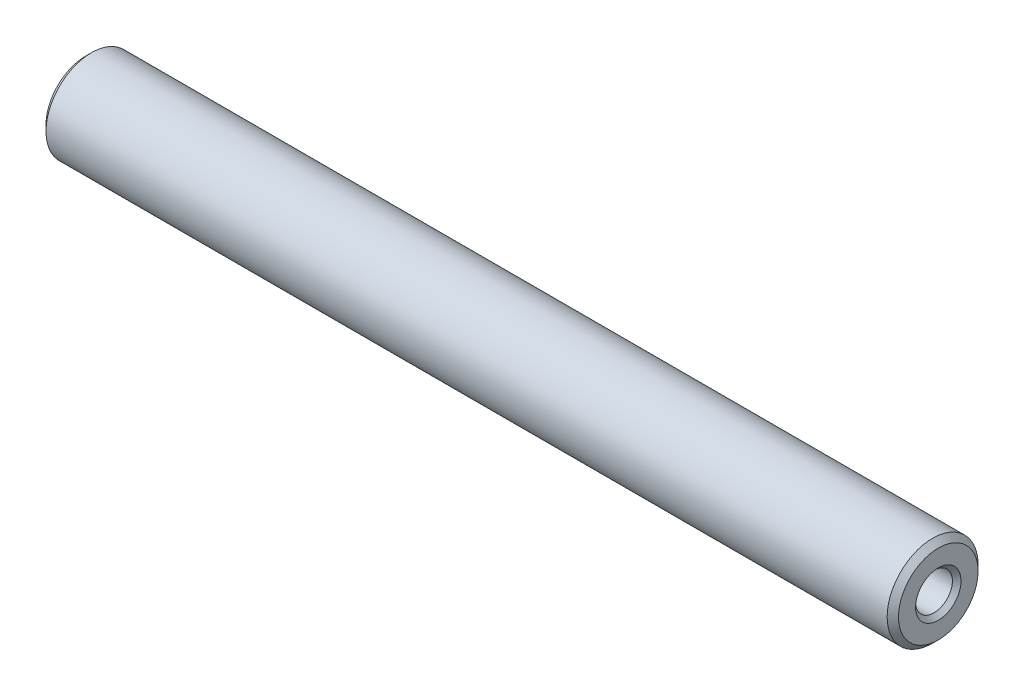
ISO-10303-21;
HEADER;
FILE_DESCRIPTION(('STEP AP214'),'2;1');
FILE_NAME('part.step','',(''),(''),'','','');
FILE_SCHEMA(('AUTOMOTIVE_DESIGN { 1 0 10303 214 1 1 1 1 }'));
ENDSEC;
DATA;
#1=APPLICATION_CONTEXT('core data for automotive mechanical design processes');
#2=APPLICATION_PROTOCOL_DEFINITION('international standard','automotive_design',2000,#1);
#3=PRODUCT_CONTEXT('',#1,'mechanical');
#4=PRODUCT('Part','Part','',(#3));
#5=PRODUCT_RELATED_PRODUCT_CATEGORY('part','',(#4));
#6=PRODUCT_DEFINITION_FORMATION('','',#4);
#7=PRODUCT_DEFINITION_CONTEXT('part definition',#1,'design');
#8=PRODUCT_DEFINITION('design','',#6,#7);
#9=PRODUCT_DEFINITION_SHAPE('','',#8);
#10=(LENGTH_UNIT() NAMED_UNIT(*) SI_UNIT(.MILLI.,.METRE.));
#11=(NAMED_UNIT(*) PLANE_ANGLE_UNIT() SI_UNIT($,.RADIAN.));
#12=(NAMED_UNIT(*) SI_UNIT($,.STERADIAN.) SOLID_ANGLE_UNIT());
#13=UNCERTAINTY_MEASURE_WITH_UNIT(LENGTH_MEASURE(1.E-05),#10,'distance_accuracy_value','');
#14=(GEOMETRIC_REPRESENTATION_CONTEXT(3) GLOBAL_UNCERTAINTY_ASSIGNED_CONTEXT((#13)) GLOBAL_UNIT_ASSIGNED_CONTEXT((#10,
#11,#12)) REPRESENTATION_CONTEXT('',''));
#15=CARTESIAN_POINT('',(0.,0.,0.));
#16=DIRECTION('',(0.,0.,1.));
#17=DIRECTION('',(1.,0.,0.));
#18=AXIS2_PLACEMENT_3D('',#15,#16,#17);
#19=CARTESIAN_POINT('',(74.9999999999945,6.4675555492763E-09,0.));
#20=DIRECTION('',(-1.,0.,0.));
#21=DIRECTION('',(0.,0.,1.));
#22=AXIS2_PLACEMENT_3D('',#19,#20,#21);
#23=CYLINDRICAL_SURFACE('',#22,1.62099999353244);
#24=CARTESIAN_POINT('',(61.935884786356,6.4675555492763E-09,0.));
#25=DIRECTION('',(-1.,0.,0.));
#26=DIRECTION('',(0.,0.,1.));
#27=AXIS2_PLACEMENT_3D('',#24,#25,#26);
#28=CIRCLE('',#27,1.62099999353244);
#29=CARTESIAN_POINT('',(61.935884786356,6.4675555492763E-09,1.62099999353244));
#30=VERTEX_POINT('',#29);
#31=EDGE_CURVE('E11',#30,#30,#28,.T.);
#32=ORIENTED_EDGE('',*,*,#31,.T.);
#33=EDGE_LOOP('',(#32));
#34=FACE_BOUND('',#33,.T.);
#35=CARTESIAN_POINT('',(74.621,6.4675555492763E-09,0.));
#36=DIRECTION('',(-1.,0.,0.));
#37=DIRECTION('',(0.,0.,1.));
#38=AXIS2_PLACEMENT_3D('',#35,#36,#37);
#39=CIRCLE('',#38,1.62099999353244);
#40=CARTESIAN_POINT('',(74.621,6.4675555492763E-09,1.62099999353244));
#41=VERTEX_POINT('',#40);
#42=EDGE_CURVE('E56',#41,#41,#39,.T.);
#43=ORIENTED_EDGE('',*,*,#42,.F.);
#44=EDGE_LOOP('',(#43));
#45=FACE_BOUND('',#44,.T.);
#46=ADVANCED_FACE('F33',(#34,#45),#23,.F.);
#47=CARTESIAN_POINT('',(61.935884786356,6.4675555492763E-09,0.));
#48=DIRECTION('',(1.,0.,0.));
#49=DIRECTION('',(0.,0.,-1.));
#50=AXIS2_PLACEMENT_3D('',#47,#48,#49);
#51=CONICAL_SURFACE('',#50,1.62099999353244,1.0471975511966);
#52=CARTESIAN_POINT('',(61.0000000037337,6.4675555492763E-09,0.));
#53=VERTEX_POINT('',#52);
#54=VERTEX_LOOP('',#53);
#55=FACE_BOUND('',#54,.T.);
#56=ORIENTED_EDGE('',*,*,#31,.F.);
#57=EDGE_LOOP('',(#56));
#58=FACE_BOUND('',#57,.T.);
#59=ADVANCED_FACE('F46',(#55,#58),#51,.F.);
#60=CARTESIAN_POINT('',(13.9999999999875,6.4675555492763E-09,0.));
#61=DIRECTION('',(-1.,0.,0.));
#62=DIRECTION('',(0.,0.,1.));
#63=AXIS2_PLACEMENT_3D('',#60,#61,#62);
#64=CONICAL_SURFACE('',#63,0.,1.04719754947489);
#65=CARTESIAN_POINT('',(13.064115213644,6.4675555492763E-09,0.));
#66=DIRECTION('',(-1.,0.,0.));
#67=DIRECTION('',(0.,0.,1.));
#68=AXIS2_PLACEMENT_3D('',#65,#66,#67);
#69=CIRCLE('',#68,1.62099999353245);
#70=CARTESIAN_POINT('',(13.064115213644,6.4675555492763E-09,1.62099999353245));
#71=VERTEX_POINT('',#70);
#72=EDGE_CURVE('E40',#71,#71,#69,.T.);
#73=ORIENTED_EDGE('',*,*,#72,.T.);
#74=EDGE_LOOP('',(#73));
#75=FACE_BOUND('',#74,.T.);
#76=CARTESIAN_POINT('',(13.9999999999875,6.4675555492763E-09,0.));
#77=VERTEX_POINT('',#76);
#78=VERTEX_LOOP('',#77);
#79=FACE_BOUND('',#78,.T.);
#80=ADVANCED_FACE('F49',(#75,#79),#64,.F.);
#81=CARTESIAN_POINT('',(74.9999999999945,6.4675555492763E-09,0.));
#82=DIRECTION('',(-1.,0.,0.));
#83=DIRECTION('',(0.,0.,1.));
#84=AXIS2_PLACEMENT_3D('',#81,#82,#83);
#85=CYLINDRICAL_SURFACE('',#84,1.62099999353245);
#86=CARTESIAN_POINT('',(0.379000000000004,6.4675555492763E-09,0.));
#87=DIRECTION('',(-1.,0.,0.));
#88=DIRECTION('',(0.,0.,1.));
#89=AXIS2_PLACEMENT_3D('',#86,#87,#88);
#90=CIRCLE('',#89,1.62099999353244);
#91=CARTESIAN_POINT('',(0.379000000000004,6.4675555492763E-09,1.62099999353244));
#92=VERTEX_POINT('',#91);
#93=EDGE_CURVE('E78',#92,#92,#90,.T.);
#94=ORIENTED_EDGE('',*,*,#93,.T.);
#95=EDGE_LOOP('',(#94));
#96=FACE_BOUND('',#95,.T.);
#97=ORIENTED_EDGE('',*,*,#72,.F.);
#98=EDGE_LOOP('',(#97));
#99=FACE_BOUND('',#98,.T.);
#100=ADVANCED_FACE('F84',(#96,#99),#85,.F.);
#101=CARTESIAN_POINT('',(0.379000000000004,6.4675555492763E-09,0.));
#102=DIRECTION('',(-1.,0.,0.));
#103=DIRECTION('',(0.,0.,1.));
#104=AXIS2_PLACEMENT_3D('',#101,#102,#103);
#105=CONICAL_SURFACE('',#104,1.62099999353244,0.785398163397442);
#106=CARTESIAN_POINT('',(0.,6.4675555492763E-09,0.));
#107=DIRECTION('',(-1.,0.,0.));
#108=DIRECTION('',(0.,0.,1.));
#109=AXIS2_PLACEMENT_3D('',#106,#107,#108);
#110=CIRCLE('',#109,1.99999999353244);
#111=CARTESIAN_POINT('',(0.,6.4675555492763E-09,1.99999999353244));
#112=VERTEX_POINT('',#111);
#113=EDGE_CURVE('E75',#112,#112,#110,.T.);
#114=ORIENTED_EDGE('',*,*,#113,.T.);
#115=EDGE_LOOP('',(#114));
#116=FACE_BOUND('',#115,.T.);
#117=ORIENTED_EDGE('',*,*,#93,.F.);
#118=EDGE_LOOP('',(#117));
#119=FACE_BOUND('',#118,.T.);
#120=ADVANCED_FACE('F86',(#116,#119),#105,.F.);
#121=CARTESIAN_POINT('',(0.,2.,0.));
#122=DIRECTION('',(-1.,0.,0.));
#123=DIRECTION('',(0.,0.,1.));
#124=AXIS2_PLACEMENT_3D('',#121,#122,#123);
#125=PLANE('',#124);
#126=CARTESIAN_POINT('',(0.,6.4675555492763E-09,0.));
#127=DIRECTION('',(-1.,0.,0.));
#128=DIRECTION('',(0.,0.,1.));
#129=AXIS2_PLACEMENT_3D('',#126,#127,#128);
#130=CIRCLE('',#129,3.49999999353244);
#131=CARTESIAN_POINT('',(0.,6.4675555492763E-09,3.49999999353244));
#132=VERTEX_POINT('',#131);
#133=EDGE_CURVE('E72',#132,#132,#130,.T.);
#134=ORIENTED_EDGE('',*,*,#133,.T.);
#135=EDGE_LOOP('',(#134));
#136=FACE_BOUND('',#135,.T.);
#137=ORIENTED_EDGE('',*,*,#113,.F.);
#138=EDGE_LOOP('',(#137));
#139=FACE_BOUND('',#138,.T.);
#140=ADVANCED_FACE('F93',(#136,#139),#125,.T.);
#141=CARTESIAN_POINT('',(0.,6.4675555492763E-09,0.));
#142=DIRECTION('',(1.,0.,0.));
#143=DIRECTION('',(0.,0.,-1.));
#144=AXIS2_PLACEMENT_3D('',#141,#142,#143);
#145=CONICAL_SURFACE('',#144,3.49999999353244,0.785398163397457);
#146=CARTESIAN_POINT('',(0.5,6.4675555492763E-09,0.));
#147=DIRECTION('',(-1.,0.,0.));
#148=DIRECTION('',(0.,0.,1.));
#149=AXIS2_PLACEMENT_3D('',#146,#147,#148);
#150=CIRCLE('',#149,3.99999999353245);
#151=CARTESIAN_POINT('',(0.5,6.4675555492763E-09,3.99999999353245));
#152=VERTEX_POINT('',#151);
#153=EDGE_CURVE('E69',#152,#152,#150,.T.);
#154=ORIENTED_EDGE('',*,*,#153,.T.);
#155=EDGE_LOOP('',(#154));
#156=FACE_BOUND('',#155,.T.);
#157=ORIENTED_EDGE('',*,*,#133,.F.);
#158=EDGE_LOOP('',(#157));
#159=FACE_BOUND('',#158,.T.);
#160=ADVANCED_FACE('F100',(#156,#159),#145,.T.);
#161=CARTESIAN_POINT('',(74.9999999999945,6.4675555492763E-09,0.));
#162=DIRECTION('',(-1.,0.,0.));
#163=DIRECTION('',(0.,0.,1.));
#164=AXIS2_PLACEMENT_3D('',#161,#162,#163);
#165=CYLINDRICAL_SURFACE('',#164,3.99999999353245);
#166=CARTESIAN_POINT('',(74.5,6.4675555492763E-09,0.));
#167=DIRECTION('',(-1.,0.,0.));
#168=DIRECTION('',(0.,0.,1.));
#169=AXIS2_PLACEMENT_3D('',#166,#167,#168);
#170=CIRCLE('',#169,3.99999999353244);
#171=CARTESIAN_POINT('',(74.5,6.4675555492763E-09,3.99999999353244));
#172=VERTEX_POINT('',#171);
#173=EDGE_CURVE('E66',#172,#172,#170,.T.);
#174=ORIENTED_EDGE('',*,*,#173,.T.);
#175=EDGE_LOOP('',(#174));
#176=FACE_BOUND('',#175,.T.);
#177=ORIENTED_EDGE('',*,*,#153,.F.);
#178=EDGE_LOOP('',(#177));
#179=FACE_BOUND('',#178,.T.);
#180=ADVANCED_FACE('F104',(#176,#179),#165,.T.);
#181=CARTESIAN_POINT('',(74.5,6.4675555492763E-09,0.));
#182=DIRECTION('',(-1.,0.,0.));
#183=DIRECTION('',(0.,0.,1.));
#184=AXIS2_PLACEMENT_3D('',#181,#182,#183);
#185=CONICAL_SURFACE('',#184,3.99999999353244,0.785398163397448);
#186=CARTESIAN_POINT('',(75.,6.4675555492763E-09,0.));
#187=DIRECTION('',(-1.,0.,0.));
#188=DIRECTION('',(0.,0.,1.));
#189=AXIS2_PLACEMENT_3D('',#186,#187,#188);
#190=CIRCLE('',#189,3.49999999353244);
#191=CARTESIAN_POINT('',(75.,6.4675555492763E-09,3.49999999353244));
#192=VERTEX_POINT('',#191);
#193=EDGE_CURVE('E61',#192,#192,#190,.T.);
#194=ORIENTED_EDGE('',*,*,#193,.T.);
#195=EDGE_LOOP('',(#194));
#196=FACE_BOUND('',#195,.T.);
#197=ORIENTED_EDGE('',*,*,#173,.F.);
#198=EDGE_LOOP('',(#197));
#199=FACE_BOUND('',#198,.T.);
#200=ADVANCED_FACE('F108',(#196,#199),#185,.T.);
#201=CARTESIAN_POINT('',(75.,3.5,0.));
#202=DIRECTION('',(1.,0.,0.));
#203=DIRECTION('',(0.,0.,-1.));
#204=AXIS2_PLACEMENT_3D('',#201,#202,#203);
#205=PLANE('',#204);
#206=CARTESIAN_POINT('',(75.,6.4675555492763E-09,0.));
#207=DIRECTION('',(-1.,0.,0.));
#208=DIRECTION('',(0.,0.,1.));
#209=AXIS2_PLACEMENT_3D('',#206,#207,#208);
#210=CIRCLE('',#209,1.99999999353244);
#211=CARTESIAN_POINT('',(75.,6.4675555492763E-09,1.99999999353244));
#212=VERTEX_POINT('',#211);
#213=EDGE_CURVE('E58',#212,#212,#210,.T.);
#214=ORIENTED_EDGE('',*,*,#213,.T.);
#215=EDGE_LOOP('',(#214));
#216=FACE_BOUND('',#215,.T.);
#217=ORIENTED_EDGE('',*,*,#193,.F.);
#218=EDGE_LOOP('',(#217));
#219=FACE_BOUND('',#218,.T.);
#220=ADVANCED_FACE('F112',(#216,#219),#205,.T.);
#221=CARTESIAN_POINT('',(75.,6.4675555492763E-09,0.));
#222=DIRECTION('',(1.,0.,0.));
#223=DIRECTION('',(0.,0.,-1.));
#224=AXIS2_PLACEMENT_3D('',#221,#222,#223);
#225=CONICAL_SURFACE('',#224,1.99999999353244,0.785398163397442);
#226=ORIENTED_EDGE('',*,*,#42,.T.);
#227=EDGE_LOOP('',(#226));
#228=FACE_BOUND('',#227,.T.);
#229=ORIENTED_EDGE('',*,*,#213,.F.);
#230=EDGE_LOOP('',(#229));
#231=FACE_BOUND('',#230,.T.);
#232=ADVANCED_FACE('F116',(#228,#231),#225,.F.);
#233=CLOSED_SHELL('',(#46,#59,#80,#100,#120,#140,#160,#180,#200,#220,#232));
#234=MANIFOLD_SOLID_BREP('B2',#233);
#235=ADVANCED_BREP_SHAPE_REPRESENTATION('',(#18,#234),#14);
#236=SHAPE_DEFINITION_REPRESENTATION(#9,#235);
ENDSEC;
END-ISO-10303-21;
